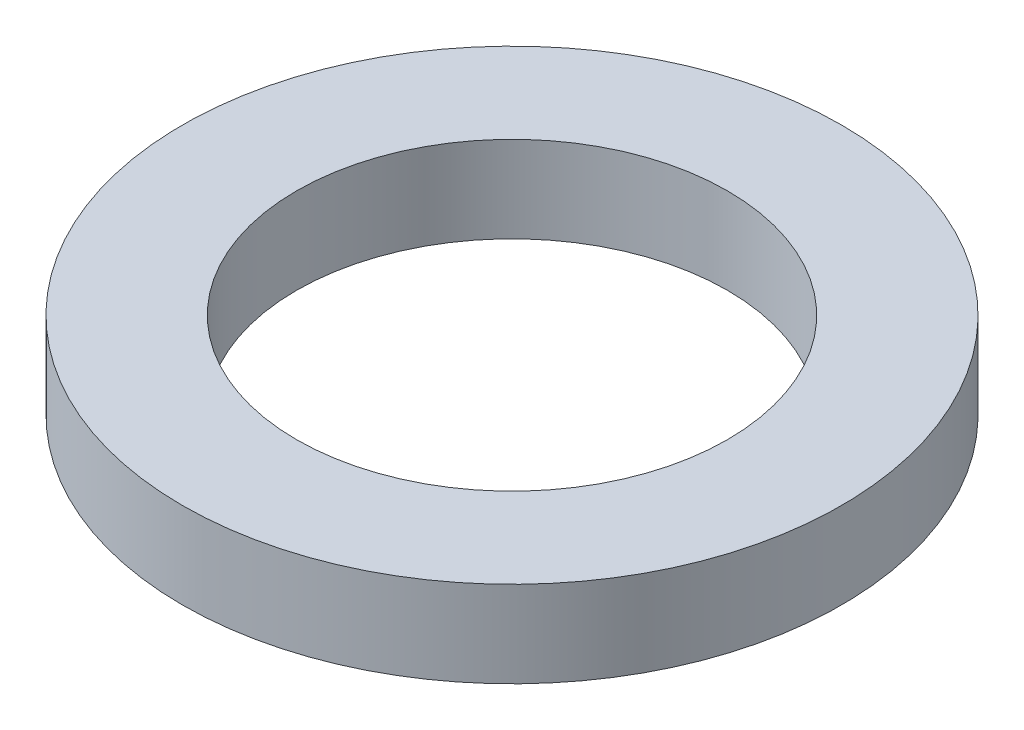
ISO-10303-21;
HEADER;
FILE_DESCRIPTION(('STEP AP214'),'2;1');
FILE_NAME('part.step','',(''),(''),'','','');
FILE_SCHEMA(('AUTOMOTIVE_DESIGN { 1 0 10303 214 1 1 1 1 }'));
ENDSEC;
DATA;
#1=APPLICATION_CONTEXT('core data for automotive mechanical design processes');
#2=APPLICATION_PROTOCOL_DEFINITION('international standard','automotive_design',2000,#1);
#3=PRODUCT_CONTEXT('',#1,'mechanical');
#4=PRODUCT('Part','Part','',(#3));
#5=PRODUCT_RELATED_PRODUCT_CATEGORY('part','',(#4));
#6=PRODUCT_DEFINITION_FORMATION('','',#4);
#7=PRODUCT_DEFINITION_CONTEXT('part definition',#1,'design');
#8=PRODUCT_DEFINITION('design','',#6,#7);
#9=PRODUCT_DEFINITION_SHAPE('','',#8);
#10=(LENGTH_UNIT() NAMED_UNIT(*) SI_UNIT(.MILLI.,.METRE.));
#11=(NAMED_UNIT(*) PLANE_ANGLE_UNIT() SI_UNIT($,.RADIAN.));
#12=(NAMED_UNIT(*) SI_UNIT($,.STERADIAN.) SOLID_ANGLE_UNIT());
#13=UNCERTAINTY_MEASURE_WITH_UNIT(LENGTH_MEASURE(1.E-05),#10,'distance_accuracy_value','');
#14=(GEOMETRIC_REPRESENTATION_CONTEXT(3) GLOBAL_UNCERTAINTY_ASSIGNED_CONTEXT((#13)) GLOBAL_UNIT_ASSIGNED_CONTEXT((#10,
#11,#12)) REPRESENTATION_CONTEXT('',''));
#15=CARTESIAN_POINT('',(0.,0.,0.));
#16=DIRECTION('',(0.,0.,1.));
#17=DIRECTION('',(1.,0.,0.));
#18=AXIS2_PLACEMENT_3D('',#15,#16,#17);
#19=CARTESIAN_POINT('',(0.,17.,0.));
#20=DIRECTION('',(0.,-1.,0.));
#21=DIRECTION('',(0.,0.,-1.));
#22=AXIS2_PLACEMENT_3D('',#19,#20,#21);
#23=CYLINDRICAL_SURFACE('',#22,65.);
#24=CARTESIAN_POINT('',(0.,17.,0.));
#25=DIRECTION('',(0.,1.,0.));
#26=DIRECTION('',(0.,0.,1.));
#27=AXIS2_PLACEMENT_3D('',#24,#25,#26);
#28=CIRCLE('',#27,65.);
#29=CARTESIAN_POINT('',(0.,17.,65.));
#30=VERTEX_POINT('',#29);
#31=EDGE_CURVE('E10',#30,#30,#28,.T.);
#32=ORIENTED_EDGE('',*,*,#31,.F.);
#33=EDGE_LOOP('',(#32));
#34=FACE_BOUND('',#33,.T.);
#35=CARTESIAN_POINT('',(0.,0.,0.));
#36=DIRECTION('',(0.,1.,0.));
#37=DIRECTION('',(0.,0.,1.));
#38=AXIS2_PLACEMENT_3D('',#35,#36,#37);
#39=CIRCLE('',#38,65.);
#40=CARTESIAN_POINT('',(0.,0.,65.));
#41=VERTEX_POINT('',#40);
#42=EDGE_CURVE('E37',#41,#41,#39,.T.);
#43=ORIENTED_EDGE('',*,*,#42,.T.);
#44=EDGE_LOOP('',(#43));
#45=FACE_BOUND('',#44,.T.);
#46=ADVANCED_FACE('F40',(#34,#45),#23,.T.);
#47=CARTESIAN_POINT('',(0.,17.,0.));
#48=DIRECTION('',(0.,1.,0.));
#49=DIRECTION('',(0.,0.,1.));
#50=AXIS2_PLACEMENT_3D('',#47,#48,#49);
#51=PLANE('',#50);
#52=CARTESIAN_POINT('',(0.,17.,0.));
#53=DIRECTION('',(0.,1.,0.));
#54=DIRECTION('',(0.,0.,1.));
#55=AXIS2_PLACEMENT_3D('',#52,#53,#54);
#56=CIRCLE('',#55,42.5);
#57=CARTESIAN_POINT('',(0.,17.,42.5));
#58=VERTEX_POINT('',#57);
#59=EDGE_CURVE('E50',#58,#58,#56,.T.);
#60=ORIENTED_EDGE('',*,*,#59,.F.);
#61=EDGE_LOOP('',(#60));
#62=FACE_BOUND('',#61,.T.);
#63=ORIENTED_EDGE('',*,*,#31,.T.);
#64=EDGE_LOOP('',(#63));
#65=FACE_BOUND('',#64,.T.);
#66=ADVANCED_FACE('F59',(#62,#65),#51,.T.);
#67=CARTESIAN_POINT('',(0.,0.,0.));
#68=DIRECTION('',(0.,1.,0.));
#69=DIRECTION('',(0.,0.,1.));
#70=AXIS2_PLACEMENT_3D('',#67,#68,#69);
#71=PLANE('',#70);
#72=CARTESIAN_POINT('',(0.,0.,0.));
#73=DIRECTION('',(0.,1.,0.));
#74=DIRECTION('',(0.,0.,1.));
#75=AXIS2_PLACEMENT_3D('',#72,#73,#74);
#76=CIRCLE('',#75,42.5);
#77=CARTESIAN_POINT('',(0.,0.,42.5));
#78=VERTEX_POINT('',#77);
#79=EDGE_CURVE('E47',#78,#78,#76,.T.);
#80=ORIENTED_EDGE('',*,*,#79,.T.);
#81=EDGE_LOOP('',(#80));
#82=FACE_BOUND('',#81,.T.);
#83=ORIENTED_EDGE('',*,*,#42,.F.);
#84=EDGE_LOOP('',(#83));
#85=FACE_BOUND('',#84,.T.);
#86=ADVANCED_FACE('F58',(#82,#85),#71,.F.);
#87=CARTESIAN_POINT('',(0.,17.,0.));
#88=DIRECTION('',(0.,-1.,0.));
#89=DIRECTION('',(0.,0.,-1.));
#90=AXIS2_PLACEMENT_3D('',#87,#88,#89);
#91=CYLINDRICAL_SURFACE('',#90,42.5);
#92=ORIENTED_EDGE('',*,*,#59,.T.);
#93=EDGE_LOOP('',(#92));
#94=FACE_BOUND('',#93,.T.);
#95=ORIENTED_EDGE('',*,*,#79,.F.);
#96=EDGE_LOOP('',(#95));
#97=FACE_BOUND('',#96,.T.);
#98=ADVANCED_FACE('F54',(#94,#97),#91,.F.);
#99=CLOSED_SHELL('',(#46,#66,#86,#98));
#100=MANIFOLD_SOLID_BREP('B2',#99);
#101=ADVANCED_BREP_SHAPE_REPRESENTATION('',(#18,#100),#14);
#102=SHAPE_DEFINITION_REPRESENTATION(#9,#101);
ENDSEC;
END-ISO-10303-21;
